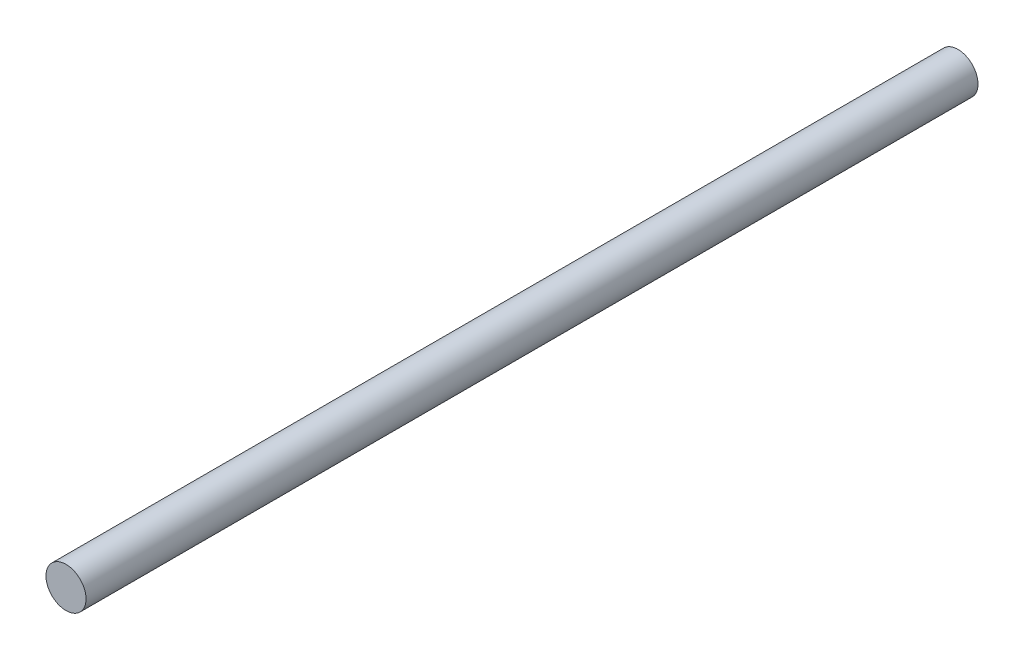
ISO-10303-21;
HEADER;
FILE_DESCRIPTION(('STEP AP214'),'2;1');
FILE_NAME('part.step','',(''),(''),'','','');
FILE_SCHEMA(('AUTOMOTIVE_DESIGN { 1 0 10303 214 1 1 1 1 }'));
ENDSEC;
DATA;
#1=APPLICATION_CONTEXT('core data for automotive mechanical design processes');
#2=APPLICATION_PROTOCOL_DEFINITION('international standard','automotive_design',2000,#1);
#3=PRODUCT_CONTEXT('',#1,'mechanical');
#4=PRODUCT('Part','Part','',(#3));
#5=PRODUCT_RELATED_PRODUCT_CATEGORY('part','',(#4));
#6=PRODUCT_DEFINITION_FORMATION('','',#4);
#7=PRODUCT_DEFINITION_CONTEXT('part definition',#1,'design');
#8=PRODUCT_DEFINITION('design','',#6,#7);
#9=PRODUCT_DEFINITION_SHAPE('','',#8);
#10=(LENGTH_UNIT() NAMED_UNIT(*) SI_UNIT(.MILLI.,.METRE.));
#11=(NAMED_UNIT(*) PLANE_ANGLE_UNIT() SI_UNIT($,.RADIAN.));
#12=(NAMED_UNIT(*) SI_UNIT($,.STERADIAN.) SOLID_ANGLE_UNIT());
#13=UNCERTAINTY_MEASURE_WITH_UNIT(LENGTH_MEASURE(1.E-05),#10,'distance_accuracy_value','');
#14=(GEOMETRIC_REPRESENTATION_CONTEXT(3) GLOBAL_UNCERTAINTY_ASSIGNED_CONTEXT((#13)) GLOBAL_UNIT_ASSIGNED_CONTEXT((#10,
#11,#12)) REPRESENTATION_CONTEXT('',''));
#15=CARTESIAN_POINT('',(0.,0.,0.));
#16=DIRECTION('',(0.,0.,1.));
#17=DIRECTION('',(1.,0.,0.));
#18=AXIS2_PLACEMENT_3D('',#15,#16,#17);
#19=CARTESIAN_POINT('',(0.,0.,89.));
#20=DIRECTION('',(0.,0.,-1.));
#21=DIRECTION('',(-1.,0.,0.));
#22=AXIS2_PLACEMENT_3D('',#19,#20,#21);
#23=CYLINDRICAL_SURFACE('',#22,4.);
#24=CARTESIAN_POINT('',(0.,0.,89.));
#25=DIRECTION('',(0.,0.,1.));
#26=DIRECTION('',(1.,0.,0.));
#27=AXIS2_PLACEMENT_3D('',#24,#25,#26);
#28=CIRCLE('',#27,4.);
#29=CARTESIAN_POINT('',(4.,0.,89.));
#30=VERTEX_POINT('',#29);
#31=EDGE_CURVE('E10',#30,#30,#28,.T.);
#32=ORIENTED_EDGE('',*,*,#31,.F.);
#33=EDGE_LOOP('',(#32));
#34=FACE_BOUND('',#33,.T.);
#35=CARTESIAN_POINT('',(0.,0.,-89.));
#36=DIRECTION('',(0.,0.,1.));
#37=DIRECTION('',(1.,0.,0.));
#38=AXIS2_PLACEMENT_3D('',#35,#36,#37);
#39=CIRCLE('',#38,4.);
#40=CARTESIAN_POINT('',(4.,0.,-89.));
#41=VERTEX_POINT('',#40);
#42=EDGE_CURVE('E35',#41,#41,#39,.T.);
#43=ORIENTED_EDGE('',*,*,#42,.T.);
#44=EDGE_LOOP('',(#43));
#45=FACE_BOUND('',#44,.T.);
#46=ADVANCED_FACE('F32',(#34,#45),#23,.T.);
#47=CARTESIAN_POINT('',(0.,0.,89.));
#48=DIRECTION('',(0.,0.,1.));
#49=DIRECTION('',(1.,0.,0.));
#50=AXIS2_PLACEMENT_3D('',#47,#48,#49);
#51=PLANE('',#50);
#52=ORIENTED_EDGE('',*,*,#31,.T.);
#53=EDGE_LOOP('',(#52));
#54=FACE_BOUND('',#53,.T.);
#55=ADVANCED_FACE('F47',(#54),#51,.T.);
#56=CARTESIAN_POINT('',(0.,0.,-89.));
#57=DIRECTION('',(0.,0.,1.));
#58=DIRECTION('',(1.,0.,0.));
#59=AXIS2_PLACEMENT_3D('',#56,#57,#58);
#60=PLANE('',#59);
#61=ORIENTED_EDGE('',*,*,#42,.F.);
#62=EDGE_LOOP('',(#61));
#63=FACE_BOUND('',#62,.T.);
#64=ADVANCED_FACE('F45',(#63),#60,.F.);
#65=CLOSED_SHELL('',(#46,#55,#64));
#66=MANIFOLD_SOLID_BREP('B2',#65);
#67=ADVANCED_BREP_SHAPE_REPRESENTATION('',(#18,#66),#14);
#68=SHAPE_DEFINITION_REPRESENTATION(#9,#67);
ENDSEC;
END-ISO-10303-21;
